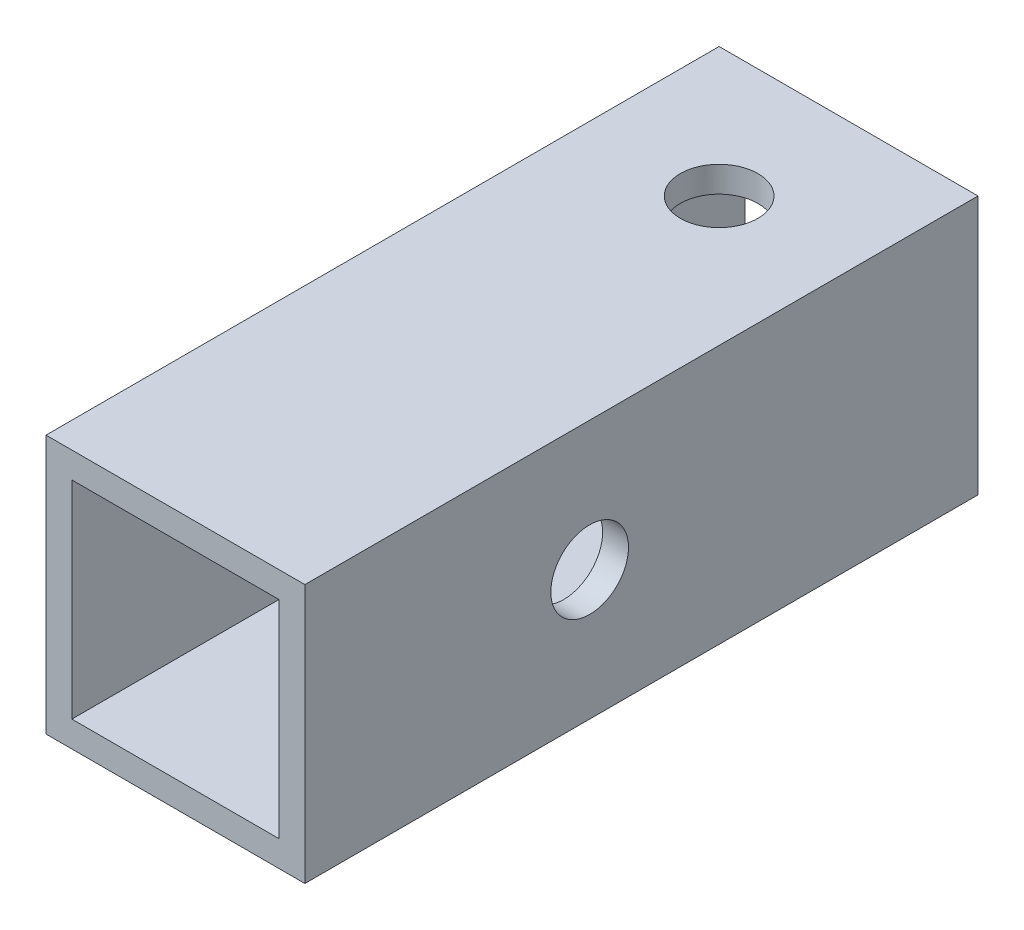
ISO-10303-21;
HEADER;
FILE_DESCRIPTION(('STEP AP214'),'2;1');
FILE_NAME('part.step','',(''),(''),'','','');
FILE_SCHEMA(('AUTOMOTIVE_DESIGN { 1 0 10303 214 1 1 1 1 }'));
ENDSEC;
DATA;
#1=APPLICATION_CONTEXT('core data for automotive mechanical design processes');
#2=APPLICATION_PROTOCOL_DEFINITION('international standard','automotive_design',2000,#1);
#3=PRODUCT_CONTEXT('',#1,'mechanical');
#4=PRODUCT('Part','Part','',(#3));
#5=PRODUCT_RELATED_PRODUCT_CATEGORY('part','',(#4));
#6=PRODUCT_DEFINITION_FORMATION('','',#4);
#7=PRODUCT_DEFINITION_CONTEXT('part definition',#1,'design');
#8=PRODUCT_DEFINITION('design','',#6,#7);
#9=PRODUCT_DEFINITION_SHAPE('','',#8);
#10=(LENGTH_UNIT() NAMED_UNIT(*) SI_UNIT(.MILLI.,.METRE.));
#11=(NAMED_UNIT(*) PLANE_ANGLE_UNIT() SI_UNIT($,.RADIAN.));
#12=(NAMED_UNIT(*) SI_UNIT($,.STERADIAN.) SOLID_ANGLE_UNIT());
#13=UNCERTAINTY_MEASURE_WITH_UNIT(LENGTH_MEASURE(1.E-05),#10,'distance_accuracy_value','');
#14=(GEOMETRIC_REPRESENTATION_CONTEXT(3) GLOBAL_UNCERTAINTY_ASSIGNED_CONTEXT((#13)) GLOBAL_UNIT_ASSIGNED_CONTEXT((#10,
#11,#12)) REPRESENTATION_CONTEXT('',''));
#15=CARTESIAN_POINT('',(0.,0.,0.));
#16=DIRECTION('',(0.,0.,1.));
#17=DIRECTION('',(1.,0.,0.));
#18=AXIS2_PLACEMENT_3D('',#15,#16,#17);
#19=CARTESIAN_POINT('',(0.,0.,26.));
#20=DIRECTION('',(0.,0.,1.));
#21=DIRECTION('',(1.,0.,0.));
#22=AXIS2_PLACEMENT_3D('',#19,#20,#21);
#23=PLANE('',#22);
#24=DIRECTION('',(0.,-1.,0.));
#25=VECTOR('',#24,1.);
#26=CARTESIAN_POINT('',(-5.,5.,26.));
#27=LINE('',#26,#25);
#28=CARTESIAN_POINT('',(-5.,5.,26.));
#29=VERTEX_POINT('',#28);
#30=CARTESIAN_POINT('',(-5.,-5.,26.));
#31=VERTEX_POINT('',#30);
#32=EDGE_CURVE('E167',#29,#31,#27,.T.);
#33=ORIENTED_EDGE('',*,*,#32,.T.);
#34=DIRECTION('',(1.,0.,0.));
#35=VECTOR('',#34,1.);
#36=CARTESIAN_POINT('',(-5.,-5.,26.));
#37=LINE('',#36,#35);
#38=CARTESIAN_POINT('',(4.99999999999999,-5.,26.));
#39=VERTEX_POINT('',#38);
#40=EDGE_CURVE('E170',#31,#39,#37,.T.);
#41=ORIENTED_EDGE('',*,*,#40,.T.);
#42=DIRECTION('',(0.,1.,0.));
#43=VECTOR('',#42,1.);
#44=CARTESIAN_POINT('',(4.99999999999999,5.,26.));
#45=LINE('',#44,#43);
#46=CARTESIAN_POINT('',(4.99999999999999,5.,26.));
#47=VERTEX_POINT('',#46);
#48=EDGE_CURVE('E173',#39,#47,#45,.T.);
#49=ORIENTED_EDGE('',*,*,#48,.T.);
#50=DIRECTION('',(-1.,0.,0.));
#51=VECTOR('',#50,1.);
#52=CARTESIAN_POINT('',(-5.,5.,26.));
#53=LINE('',#52,#51);
#54=EDGE_CURVE('E175',#47,#29,#53,.T.);
#55=ORIENTED_EDGE('',*,*,#54,.T.);
#56=EDGE_LOOP('',(#33,#41,#49,#55));
#57=FACE_BOUND('',#56,.T.);
#58=DIRECTION('',(1.,0.,0.));
#59=VECTOR('',#58,1.);
#60=CARTESIAN_POINT('',(-5.,-4.,26.));
#61=LINE('',#60,#59);
#62=CARTESIAN_POINT('',(-4.,-4.,26.));
#63=VERTEX_POINT('',#62);
#64=CARTESIAN_POINT('',(3.99999999999999,-4.,26.));
#65=VERTEX_POINT('',#64);
#66=EDGE_CURVE('E137',#63,#65,#61,.T.);
#67=ORIENTED_EDGE('',*,*,#66,.F.);
#68=DIRECTION('',(0.,-1.,0.));
#69=VECTOR('',#68,1.);
#70=CARTESIAN_POINT('',(-4.,5.,26.));
#71=LINE('',#70,#69);
#72=CARTESIAN_POINT('',(-4.,4.,26.));
#73=VERTEX_POINT('',#72);
#74=EDGE_CURVE('E129',#73,#63,#71,.T.);
#75=ORIENTED_EDGE('',*,*,#74,.F.);
#76=DIRECTION('',(-1.,0.,0.));
#77=VECTOR('',#76,1.);
#78=CARTESIAN_POINT('',(-5.,4.,26.));
#79=LINE('',#78,#77);
#80=CARTESIAN_POINT('',(3.99999999999999,4.,26.));
#81=VERTEX_POINT('',#80);
#82=EDGE_CURVE('E151',#81,#73,#79,.T.);
#83=ORIENTED_EDGE('',*,*,#82,.F.);
#84=DIRECTION('',(0.,1.,0.));
#85=VECTOR('',#84,1.);
#86=CARTESIAN_POINT('',(3.99999999999999,5.,26.));
#87=LINE('',#86,#85);
#88=EDGE_CURVE('E149',#65,#81,#87,.T.);
#89=ORIENTED_EDGE('',*,*,#88,.F.);
#90=EDGE_LOOP('',(#67,#75,#83,#89));
#91=FACE_BOUND('',#90,.T.);
#92=ADVANCED_FACE('F62',(#57,#91),#23,.T.);
#93=CARTESIAN_POINT('',(0.,0.,0.));
#94=DIRECTION('',(0.,0.,1.));
#95=DIRECTION('',(1.,0.,0.));
#96=AXIS2_PLACEMENT_3D('',#93,#94,#95);
#97=PLANE('',#96);
#98=DIRECTION('',(0.,-1.,0.));
#99=VECTOR('',#98,1.);
#100=CARTESIAN_POINT('',(-5.,5.,0.));
#101=LINE('',#100,#99);
#102=CARTESIAN_POINT('',(-5.,5.,0.));
#103=VERTEX_POINT('',#102);
#104=CARTESIAN_POINT('',(-5.,-5.,0.));
#105=VERTEX_POINT('',#104);
#106=EDGE_CURVE('E145',#103,#105,#101,.T.);
#107=ORIENTED_EDGE('',*,*,#106,.F.);
#108=DIRECTION('',(-1.,0.,0.));
#109=VECTOR('',#108,1.);
#110=CARTESIAN_POINT('',(-5.,5.,0.));
#111=LINE('',#110,#109);
#112=CARTESIAN_POINT('',(4.99999999999999,5.,0.));
#113=VERTEX_POINT('',#112);
#114=EDGE_CURVE('E171',#113,#103,#111,.T.);
#115=ORIENTED_EDGE('',*,*,#114,.F.);
#116=DIRECTION('',(0.,1.,0.));
#117=VECTOR('',#116,1.);
#118=CARTESIAN_POINT('',(4.99999999999999,5.,0.));
#119=LINE('',#118,#117);
#120=CARTESIAN_POINT('',(4.99999999999999,-5.,0.));
#121=VERTEX_POINT('',#120);
#122=EDGE_CURVE('E182',#121,#113,#119,.T.);
#123=ORIENTED_EDGE('',*,*,#122,.F.);
#124=DIRECTION('',(1.,0.,0.));
#125=VECTOR('',#124,1.);
#126=CARTESIAN_POINT('',(-5.,-5.,0.));
#127=LINE('',#126,#125);
#128=EDGE_CURVE('E180',#105,#121,#127,.T.);
#129=ORIENTED_EDGE('',*,*,#128,.F.);
#130=EDGE_LOOP('',(#107,#115,#123,#129));
#131=FACE_BOUND('',#130,.T.);
#132=DIRECTION('',(0.,-1.,0.));
#133=VECTOR('',#132,1.);
#134=CARTESIAN_POINT('',(-4.,5.,0.));
#135=LINE('',#134,#133);
#136=CARTESIAN_POINT('',(-4.,4.,0.));
#137=VERTEX_POINT('',#136);
#138=CARTESIAN_POINT('',(-4.,-4.,0.));
#139=VERTEX_POINT('',#138);
#140=EDGE_CURVE('E87',#137,#139,#135,.T.);
#141=ORIENTED_EDGE('',*,*,#140,.T.);
#142=DIRECTION('',(1.,0.,0.));
#143=VECTOR('',#142,1.);
#144=CARTESIAN_POINT('',(-5.,-4.,0.));
#145=LINE('',#144,#143);
#146=CARTESIAN_POINT('',(3.99999999999999,-4.,0.));
#147=VERTEX_POINT('',#146);
#148=EDGE_CURVE('E144',#139,#147,#145,.T.);
#149=ORIENTED_EDGE('',*,*,#148,.T.);
#150=DIRECTION('',(0.,1.,0.));
#151=VECTOR('',#150,1.);
#152=CARTESIAN_POINT('',(3.99999999999999,5.,0.));
#153=LINE('',#152,#151);
#154=CARTESIAN_POINT('',(3.99999999999999,4.,0.));
#155=VERTEX_POINT('',#154);
#156=EDGE_CURVE('E159',#147,#155,#153,.T.);
#157=ORIENTED_EDGE('',*,*,#156,.T.);
#158=DIRECTION('',(-1.,0.,0.));
#159=VECTOR('',#158,1.);
#160=CARTESIAN_POINT('',(-5.,4.,0.));
#161=LINE('',#160,#159);
#162=EDGE_CURVE('E138',#155,#137,#161,.T.);
#163=ORIENTED_EDGE('',*,*,#162,.T.);
#164=EDGE_LOOP('',(#141,#149,#157,#163));
#165=FACE_BOUND('',#164,.T.);
#166=ADVANCED_FACE('F229',(#131,#165),#97,.F.);
#167=CARTESIAN_POINT('',(-5.,5.,26.));
#168=DIRECTION('',(1.,0.,0.));
#169=DIRECTION('',(0.,0.,-1.));
#170=AXIS2_PLACEMENT_3D('',#167,#168,#169);
#171=PLANE('',#170);
#172=CARTESIAN_POINT('',(-5.00000000000001,0.,15.));
#173=DIRECTION('',(1.,0.,0.));
#174=DIRECTION('',(0.,0.,-1.));
#175=AXIS2_PLACEMENT_3D('',#172,#173,#174);
#176=CIRCLE('',#175,1.5);
#177=CARTESIAN_POINT('',(-5.00000000000001,0.,13.5));
#178=VERTEX_POINT('',#177);
#179=EDGE_CURVE('E257',#178,#178,#176,.T.);
#180=ORIENTED_EDGE('',*,*,#179,.T.);
#181=EDGE_LOOP('',(#180));
#182=FACE_BOUND('',#181,.T.);
#183=ORIENTED_EDGE('',*,*,#106,.T.);
#184=DIRECTION('',(0.,0.,-1.));
#185=VECTOR('',#184,1.);
#186=CARTESIAN_POINT('',(-5.,-5.,26.));
#187=LINE('',#186,#185);
#188=EDGE_CURVE('E12',#31,#105,#187,.T.);
#189=ORIENTED_EDGE('',*,*,#188,.F.);
#190=ORIENTED_EDGE('',*,*,#32,.F.);
#191=DIRECTION('',(0.,0.,-1.));
#192=VECTOR('',#191,1.);
#193=CARTESIAN_POINT('',(-5.,5.,26.));
#194=LINE('',#193,#192);
#195=EDGE_CURVE('E177',#29,#103,#194,.T.);
#196=ORIENTED_EDGE('',*,*,#195,.T.);
#197=EDGE_LOOP('',(#183,#189,#190,#196));
#198=FACE_BOUND('',#197,.T.);
#199=ADVANCED_FACE('F64',(#182,#198),#171,.F.);
#200=CARTESIAN_POINT('',(-5.,-5.,26.));
#201=DIRECTION('',(0.,1.,0.));
#202=DIRECTION('',(0.,0.,1.));
#203=AXIS2_PLACEMENT_3D('',#200,#201,#202);
#204=PLANE('',#203);
#205=CARTESIAN_POINT('',(0.,-5.,5.));
#206=DIRECTION('',(0.,1.,0.));
#207=DIRECTION('',(0.,0.,1.));
#208=AXIS2_PLACEMENT_3D('',#205,#206,#207);
#209=CIRCLE('',#208,1.5);
#210=CARTESIAN_POINT('',(0.,-5.,6.5));
#211=VERTEX_POINT('',#210);
#212=EDGE_CURVE('E157',#211,#211,#209,.T.);
#213=ORIENTED_EDGE('',*,*,#212,.T.);
#214=EDGE_LOOP('',(#213));
#215=FACE_BOUND('',#214,.T.);
#216=ORIENTED_EDGE('',*,*,#128,.T.);
#217=DIRECTION('',(0.,0.,-1.));
#218=VECTOR('',#217,1.);
#219=CARTESIAN_POINT('',(4.99999999999999,-5.,26.));
#220=LINE('',#219,#218);
#221=EDGE_CURVE('E71',#39,#121,#220,.T.);
#222=ORIENTED_EDGE('',*,*,#221,.F.);
#223=ORIENTED_EDGE('',*,*,#40,.F.);
#224=ORIENTED_EDGE('',*,*,#188,.T.);
#225=EDGE_LOOP('',(#216,#222,#223,#224));
#226=FACE_BOUND('',#225,.T.);
#227=ADVANCED_FACE('F210',(#215,#226),#204,.F.);
#228=CARTESIAN_POINT('',(4.99999999999999,5.,26.));
#229=DIRECTION('',(-1.,0.,0.));
#230=DIRECTION('',(0.,0.,1.));
#231=AXIS2_PLACEMENT_3D('',#228,#229,#230);
#232=PLANE('',#231);
#233=CARTESIAN_POINT('',(4.99999999999999,0.,15.));
#234=DIRECTION('',(1.,0.,0.));
#235=DIRECTION('',(0.,0.,-1.));
#236=AXIS2_PLACEMENT_3D('',#233,#234,#235);
#237=CIRCLE('',#236,1.5);
#238=CARTESIAN_POINT('',(4.99999999999999,0.,13.5));
#239=VERTEX_POINT('',#238);
#240=EDGE_CURVE('E293',#239,#239,#237,.T.);
#241=ORIENTED_EDGE('',*,*,#240,.F.);
#242=EDGE_LOOP('',(#241));
#243=FACE_BOUND('',#242,.T.);
#244=ORIENTED_EDGE('',*,*,#122,.T.);
#245=DIRECTION('',(0.,0.,-1.));
#246=VECTOR('',#245,1.);
#247=CARTESIAN_POINT('',(4.99999999999999,5.,26.));
#248=LINE('',#247,#246);
#249=EDGE_CURVE('E187',#47,#113,#248,.T.);
#250=ORIENTED_EDGE('',*,*,#249,.F.);
#251=ORIENTED_EDGE('',*,*,#48,.F.);
#252=ORIENTED_EDGE('',*,*,#221,.T.);
#253=EDGE_LOOP('',(#244,#250,#251,#252));
#254=FACE_BOUND('',#253,.T.);
#255=ADVANCED_FACE('F243',(#243,#254),#232,.F.);
#256=CARTESIAN_POINT('',(-5.,5.,26.));
#257=DIRECTION('',(0.,-1.,0.));
#258=DIRECTION('',(0.,0.,-1.));
#259=AXIS2_PLACEMENT_3D('',#256,#257,#258);
#260=PLANE('',#259);
#261=CARTESIAN_POINT('',(0.,5.,5.));
#262=DIRECTION('',(0.,1.,0.));
#263=DIRECTION('',(0.,0.,1.));
#264=AXIS2_PLACEMENT_3D('',#261,#262,#263);
#265=CIRCLE('',#264,1.5);
#266=CARTESIAN_POINT('',(0.,5.,6.5));
#267=VERTEX_POINT('',#266);
#268=EDGE_CURVE('E194',#267,#267,#265,.T.);
#269=ORIENTED_EDGE('',*,*,#268,.F.);
#270=EDGE_LOOP('',(#269));
#271=FACE_BOUND('',#270,.T.);
#272=ORIENTED_EDGE('',*,*,#114,.T.);
#273=ORIENTED_EDGE('',*,*,#195,.F.);
#274=ORIENTED_EDGE('',*,*,#54,.F.);
#275=ORIENTED_EDGE('',*,*,#249,.T.);
#276=EDGE_LOOP('',(#272,#273,#274,#275));
#277=FACE_BOUND('',#276,.T.);
#278=ADVANCED_FACE('F240',(#271,#277),#260,.F.);
#279=CARTESIAN_POINT('',(-4.,5.,26.));
#280=DIRECTION('',(1.,0.,0.));
#281=DIRECTION('',(0.,0.,-1.));
#282=AXIS2_PLACEMENT_3D('',#279,#280,#281);
#283=PLANE('',#282);
#284=CARTESIAN_POINT('',(-4.,0.,15.));
#285=DIRECTION('',(1.,0.,0.));
#286=DIRECTION('',(0.,0.,-1.));
#287=AXIS2_PLACEMENT_3D('',#284,#285,#286);
#288=CIRCLE('',#287,1.5);
#289=CARTESIAN_POINT('',(-4.,0.,13.5));
#290=VERTEX_POINT('',#289);
#291=EDGE_CURVE('E200',#290,#290,#288,.T.);
#292=ORIENTED_EDGE('',*,*,#291,.F.);
#293=EDGE_LOOP('',(#292));
#294=FACE_BOUND('',#293,.T.);
#295=ORIENTED_EDGE('',*,*,#140,.F.);
#296=DIRECTION('',(0.,0.,-1.));
#297=VECTOR('',#296,1.);
#298=CARTESIAN_POINT('',(-4.,4.,26.));
#299=LINE('',#298,#297);
#300=EDGE_CURVE('E133',#73,#137,#299,.T.);
#301=ORIENTED_EDGE('',*,*,#300,.F.);
#302=ORIENTED_EDGE('',*,*,#74,.T.);
#303=DIRECTION('',(0.,0.,-1.));
#304=VECTOR('',#303,1.);
#305=CARTESIAN_POINT('',(-4.,-4.,26.));
#306=LINE('',#305,#304);
#307=EDGE_CURVE('E132',#63,#139,#306,.T.);
#308=ORIENTED_EDGE('',*,*,#307,.T.);
#309=EDGE_LOOP('',(#295,#301,#302,#308));
#310=FACE_BOUND('',#309,.T.);
#311=ADVANCED_FACE('F131',(#294,#310),#283,.T.);
#312=CARTESIAN_POINT('',(-5.,-4.,26.));
#313=DIRECTION('',(0.,1.,0.));
#314=DIRECTION('',(0.,0.,1.));
#315=AXIS2_PLACEMENT_3D('',#312,#313,#314);
#316=PLANE('',#315);
#317=CARTESIAN_POINT('',(0.,-4.,5.));
#318=DIRECTION('',(0.,1.,0.));
#319=DIRECTION('',(0.,0.,1.));
#320=AXIS2_PLACEMENT_3D('',#317,#318,#319);
#321=CIRCLE('',#320,1.5);
#322=CARTESIAN_POINT('',(0.,-4.,6.5));
#323=VERTEX_POINT('',#322);
#324=EDGE_CURVE('E193',#323,#323,#321,.T.);
#325=ORIENTED_EDGE('',*,*,#324,.F.);
#326=EDGE_LOOP('',(#325));
#327=FACE_BOUND('',#326,.T.);
#328=ORIENTED_EDGE('',*,*,#148,.F.);
#329=ORIENTED_EDGE('',*,*,#307,.F.);
#330=ORIENTED_EDGE('',*,*,#66,.T.);
#331=DIRECTION('',(0.,0.,-1.));
#332=VECTOR('',#331,1.);
#333=CARTESIAN_POINT('',(3.99999999999999,-4.,26.));
#334=LINE('',#333,#332);
#335=EDGE_CURVE('E146',#65,#147,#334,.T.);
#336=ORIENTED_EDGE('',*,*,#335,.T.);
#337=EDGE_LOOP('',(#328,#329,#330,#336));
#338=FACE_BOUND('',#337,.T.);
#339=ADVANCED_FACE('F141',(#327,#338),#316,.T.);
#340=CARTESIAN_POINT('',(3.99999999999999,5.,26.));
#341=DIRECTION('',(-1.,0.,0.));
#342=DIRECTION('',(0.,0.,1.));
#343=AXIS2_PLACEMENT_3D('',#340,#341,#342);
#344=PLANE('',#343);
#345=CARTESIAN_POINT('',(3.99999999999999,0.,15.));
#346=DIRECTION('',(-1.,0.,0.));
#347=DIRECTION('',(0.,0.,1.));
#348=AXIS2_PLACEMENT_3D('',#345,#346,#347);
#349=CIRCLE('',#348,1.5);
#350=CARTESIAN_POINT('',(3.99999999999999,0.,16.5));
#351=VERTEX_POINT('',#350);
#352=EDGE_CURVE('E66',#351,#351,#349,.T.);
#353=ORIENTED_EDGE('',*,*,#352,.F.);
#354=EDGE_LOOP('',(#353));
#355=FACE_BOUND('',#354,.T.);
#356=ORIENTED_EDGE('',*,*,#156,.F.);
#357=ORIENTED_EDGE('',*,*,#335,.F.);
#358=ORIENTED_EDGE('',*,*,#88,.T.);
#359=DIRECTION('',(0.,0.,-1.));
#360=VECTOR('',#359,1.);
#361=CARTESIAN_POINT('',(3.99999999999999,4.,26.));
#362=LINE('',#361,#360);
#363=EDGE_CURVE('E79',#81,#155,#362,.T.);
#364=ORIENTED_EDGE('',*,*,#363,.T.);
#365=EDGE_LOOP('',(#356,#357,#358,#364));
#366=FACE_BOUND('',#365,.T.);
#367=ADVANCED_FACE('F273',(#355,#366),#344,.T.);
#368=CARTESIAN_POINT('',(-5.,4.,26.));
#369=DIRECTION('',(0.,-1.,0.));
#370=DIRECTION('',(0.,0.,-1.));
#371=AXIS2_PLACEMENT_3D('',#368,#369,#370);
#372=PLANE('',#371);
#373=CARTESIAN_POINT('',(0.,4.,5.));
#374=DIRECTION('',(0.,-1.,0.));
#375=DIRECTION('',(0.,0.,-1.));
#376=AXIS2_PLACEMENT_3D('',#373,#374,#375);
#377=CIRCLE('',#376,1.5);
#378=CARTESIAN_POINT('',(0.,4.,3.5));
#379=VERTEX_POINT('',#378);
#380=EDGE_CURVE('E191',#379,#379,#377,.T.);
#381=ORIENTED_EDGE('',*,*,#380,.F.);
#382=EDGE_LOOP('',(#381));
#383=FACE_BOUND('',#382,.T.);
#384=ORIENTED_EDGE('',*,*,#162,.F.);
#385=ORIENTED_EDGE('',*,*,#363,.F.);
#386=ORIENTED_EDGE('',*,*,#82,.T.);
#387=ORIENTED_EDGE('',*,*,#300,.T.);
#388=EDGE_LOOP('',(#384,#385,#386,#387));
#389=FACE_BOUND('',#388,.T.);
#390=ADVANCED_FACE('F226',(#383,#389),#372,.T.);
#391=CARTESIAN_POINT('',(0.,-45.,5.));
#392=DIRECTION('',(0.,1.,0.));
#393=DIRECTION('',(0.,0.,1.));
#394=AXIS2_PLACEMENT_3D('',#391,#392,#393);
#395=CYLINDRICAL_SURFACE('',#394,1.5);
#396=ORIENTED_EDGE('',*,*,#380,.T.);
#397=EDGE_LOOP('',(#396));
#398=FACE_BOUND('',#397,.T.);
#399=ORIENTED_EDGE('',*,*,#268,.T.);
#400=EDGE_LOOP('',(#399));
#401=FACE_BOUND('',#400,.T.);
#402=ADVANCED_FACE('F216',(#398,#401),#395,.F.);
#403=ORIENTED_EDGE('',*,*,#324,.T.);
#404=EDGE_LOOP('',(#403));
#405=FACE_BOUND('',#404,.T.);
#406=ORIENTED_EDGE('',*,*,#212,.F.);
#407=EDGE_LOOP('',(#406));
#408=FACE_BOUND('',#407,.T.);
#409=ADVANCED_FACE('F213',(#405,#408),#395,.F.);
#410=CARTESIAN_POINT('',(-5.00000000000001,0.,15.));
#411=DIRECTION('',(1.,0.,0.));
#412=DIRECTION('',(0.,0.,-1.));
#413=AXIS2_PLACEMENT_3D('',#410,#411,#412);
#414=CYLINDRICAL_SURFACE('',#413,1.5);
#415=ORIENTED_EDGE('',*,*,#352,.T.);
#416=EDGE_LOOP('',(#415));
#417=FACE_BOUND('',#416,.T.);
#418=ORIENTED_EDGE('',*,*,#240,.T.);
#419=EDGE_LOOP('',(#418));
#420=FACE_BOUND('',#419,.T.);
#421=ADVANCED_FACE('F215',(#417,#420),#414,.F.);
#422=ORIENTED_EDGE('',*,*,#291,.T.);
#423=EDGE_LOOP('',(#422));
#424=FACE_BOUND('',#423,.T.);
#425=ORIENTED_EDGE('',*,*,#179,.F.);
#426=EDGE_LOOP('',(#425));
#427=FACE_BOUND('',#426,.T.);
#428=ADVANCED_FACE('F223',(#424,#427),#414,.F.);
#429=CLOSED_SHELL('',(#92,#166,#199,#227,#255,#278,#311,#339,#367,#390,#402,#409,#421,#428));
#430=MANIFOLD_SOLID_BREP('B2',#429);
#431=ADVANCED_BREP_SHAPE_REPRESENTATION('',(#18,#430),#14);
#432=SHAPE_DEFINITION_REPRESENTATION(#9,#431);
ENDSEC;
END-ISO-10303-21;
